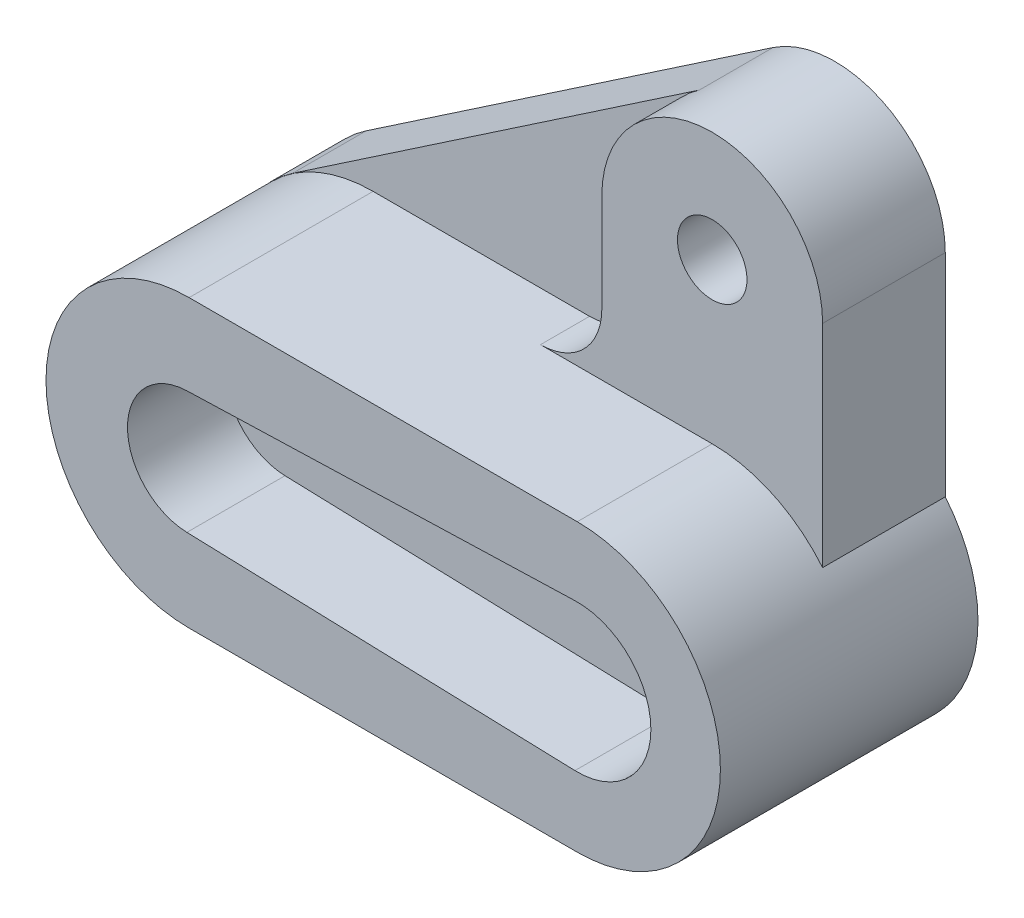
ISO-10303-21;
HEADER;
FILE_DESCRIPTION(('STEP AP214'),'2;1');
FILE_NAME('part.step','',(''),(''),'','','');
FILE_SCHEMA(('AUTOMOTIVE_DESIGN { 1 0 10303 214 1 1 1 1 }'));
ENDSEC;
DATA;
#1=APPLICATION_CONTEXT('core data for automotive mechanical design processes');
#2=APPLICATION_PROTOCOL_DEFINITION('international standard','automotive_design',2000,#1);
#3=PRODUCT_CONTEXT('',#1,'mechanical');
#4=PRODUCT('Part','Part','',(#3));
#5=PRODUCT_RELATED_PRODUCT_CATEGORY('part','',(#4));
#6=PRODUCT_DEFINITION_FORMATION('','',#4);
#7=PRODUCT_DEFINITION_CONTEXT('part definition',#1,'design');
#8=PRODUCT_DEFINITION('design','',#6,#7);
#9=PRODUCT_DEFINITION_SHAPE('','',#8);
#10=(LENGTH_UNIT() NAMED_UNIT(*) SI_UNIT(.MILLI.,.METRE.));
#11=(NAMED_UNIT(*) PLANE_ANGLE_UNIT() SI_UNIT($,.RADIAN.));
#12=(NAMED_UNIT(*) SI_UNIT($,.STERADIAN.) SOLID_ANGLE_UNIT());
#13=UNCERTAINTY_MEASURE_WITH_UNIT(LENGTH_MEASURE(1.E-05),#10,'distance_accuracy_value','');
#14=(GEOMETRIC_REPRESENTATION_CONTEXT(3) GLOBAL_UNCERTAINTY_ASSIGNED_CONTEXT((#13)) GLOBAL_UNIT_ASSIGNED_CONTEXT((#10,
#11,#12)) REPRESENTATION_CONTEXT('',''));
#15=CARTESIAN_POINT('',(0.,0.,0.));
#16=DIRECTION('',(0.,0.,1.));
#17=DIRECTION('',(1.,0.,0.));
#18=AXIS2_PLACEMENT_3D('',#15,#16,#17);
#19=CARTESIAN_POINT('',(-95.,0.,18.));
#20=DIRECTION('',(0.,0.,1.));
#21=DIRECTION('',(1.,0.,0.));
#22=AXIS2_PLACEMENT_3D('',#19,#20,#21);
#23=PLANE('',#22);
#24=DIRECTION('',(1.,0.,0.));
#25=VECTOR('',#24,1.);
#26=CARTESIAN_POINT('',(0.,35.,18.));
#27=LINE('',#26,#25);
#28=CARTESIAN_POINT('',(-94.928572612956,35.,18.));
#29=VERTEX_POINT('',#28);
#30=CARTESIAN_POINT('',(-42.,35.,18.));
#31=VERTEX_POINT('',#30);
#32=EDGE_CURVE('E239',#29,#31,#27,.T.);
#33=ORIENTED_EDGE('',*,*,#32,.T.);
#34=CARTESIAN_POINT('',(-42.,50.,18.));
#35=DIRECTION('',(0.,0.,1.));
#36=DIRECTION('',(1.,0.,0.));
#37=AXIS2_PLACEMENT_3D('',#34,#35,#36);
#38=CIRCLE('',#37,15.);
#39=CARTESIAN_POINT('',(-27.,50.,18.));
#40=VERTEX_POINT('',#39);
#41=EDGE_CURVE('E340',#31,#40,#38,.T.);
#42=ORIENTED_EDGE('',*,*,#41,.T.);
#43=DIRECTION('',(0.,-1.,0.));
#44=VECTOR('',#43,1.);
#45=CARTESIAN_POINT('',(-27.,74.,18.));
#46=LINE('',#45,#44);
#47=CARTESIAN_POINT('',(-27.,74.,18.));
#48=VERTEX_POINT('',#47);
#49=EDGE_CURVE('E225',#48,#40,#46,.T.);
#50=ORIENTED_EDGE('',*,*,#49,.F.);
#51=CARTESIAN_POINT('',(0.,74.,18.));
#52=DIRECTION('',(0.,0.,1.));
#53=DIRECTION('',(1.,0.,0.));
#54=AXIS2_PLACEMENT_3D('',#51,#52,#53);
#55=CIRCLE('',#54,27.);
#56=CARTESIAN_POINT('',(-15.1401853244956,96.3556433219876,18.));
#57=VERTEX_POINT('',#56);
#58=EDGE_CURVE('E220',#57,#48,#55,.T.);
#59=ORIENTED_EDGE('',*,*,#58,.F.);
#60=DIRECTION('',(-0.827986789703244,-0.560747604610948,0.));
#61=VECTOR('',#60,1.);
#62=CARTESIAN_POINT('',(-114.626166161383,28.9795376396135,18.));
#63=LINE('',#62,#61);
#64=CARTESIAN_POINT('',(-114.626166161383,28.9795376396135,18.));
#65=VERTEX_POINT('',#64);
#66=EDGE_CURVE('E306',#57,#65,#63,.T.);
#67=ORIENTED_EDGE('',*,*,#66,.T.);
#68=CARTESIAN_POINT('',(-95.,0.,18.));
#69=DIRECTION('',(0.,0.,1.));
#70=DIRECTION('',(1.,0.,0.));
#71=AXIS2_PLACEMENT_3D('',#68,#69,#70);
#72=CIRCLE('',#71,35.);
#73=CARTESIAN_POINT('',(-95.,-35.,18.));
#74=VERTEX_POINT('',#73);
#75=EDGE_CURVE('E300',#65,#74,#72,.T.);
#76=ORIENTED_EDGE('',*,*,#75,.T.);
#77=DIRECTION('',(1.,0.,0.));
#78=VECTOR('',#77,1.);
#79=CARTESIAN_POINT('',(-95.,-35.,18.));
#80=LINE('',#79,#78);
#81=CARTESIAN_POINT('',(-94.928572612956,-35.,18.));
#82=VERTEX_POINT('',#81);
#83=EDGE_CURVE('E303',#74,#82,#80,.T.);
#84=ORIENTED_EDGE('',*,*,#83,.T.);
#85=CARTESIAN_POINT('',(-94.928572612956,0.,18.));
#86=DIRECTION('',(0.,0.,1.));
#87=DIRECTION('',(1.,0.,0.));
#88=AXIS2_PLACEMENT_3D('',#85,#86,#87);
#89=CIRCLE('',#88,35.);
#90=EDGE_CURVE('E244',#29,#82,#89,.T.);
#91=ORIENTED_EDGE('',*,*,#90,.F.);
#92=EDGE_LOOP('',(#33,#42,#50,#59,#67,#76,#84,#91));
#93=FACE_BOUND('',#92,.T.);
#94=ADVANCED_FACE('F41',(#93),#23,.T.);
#95=CARTESIAN_POINT('',(-95.,0.,0.));
#96=DIRECTION('',(0.,0.,1.));
#97=DIRECTION('',(1.,0.,0.));
#98=AXIS2_PLACEMENT_3D('',#95,#96,#97);
#99=PLANE('',#98);
#100=DIRECTION('',(-0.999501260671092,0.0315789473684354,0.));
#101=VECTOR('',#100,1.);
#102=CARTESIAN_POINT('',(-0.568421052631323,-17.9910226920797,0.));
#103=LINE('',#102,#101);
#104=CARTESIAN_POINT('',(-0.568421052631315,-17.9910226920797,0.));
#105=VERTEX_POINT('',#104);
#106=CARTESIAN_POINT('',(-95.4736842105266,-14.9925189100664,0.));
#107=VERTEX_POINT('',#106);
#108=EDGE_CURVE('E280',#105,#107,#103,.T.);
#109=ORIENTED_EDGE('',*,*,#108,.F.);
#110=CARTESIAN_POINT('',(0.,0.,0.));
#111=DIRECTION('',(0.,0.,-1.));
#112=DIRECTION('',(-1.,0.,0.));
#113=AXIS2_PLACEMENT_3D('',#110,#111,#112);
#114=CIRCLE('',#113,18.);
#115=CARTESIAN_POINT('',(-0.568421052631832,17.9910226920797,0.));
#116=VERTEX_POINT('',#115);
#117=EDGE_CURVE('E264',#116,#105,#114,.T.);
#118=ORIENTED_EDGE('',*,*,#117,.F.);
#119=DIRECTION('',(0.999501260671092,0.0315789473684352,0.));
#120=VECTOR('',#119,1.);
#121=CARTESIAN_POINT('',(-0.568421052631832,17.9910226920797,0.));
#122=LINE('',#121,#120);
#123=CARTESIAN_POINT('',(-95.4736842105266,14.992518910065,0.));
#124=VERTEX_POINT('',#123);
#125=EDGE_CURVE('E269',#124,#116,#122,.T.);
#126=ORIENTED_EDGE('',*,*,#125,.F.);
#127=CARTESIAN_POINT('',(-95.,-1.34422204270401E-12,0.));
#128=DIRECTION('',(0.,0.,-1.));
#129=DIRECTION('',(-1.,0.,0.));
#130=AXIS2_PLACEMENT_3D('',#127,#128,#129);
#131=CIRCLE('',#130,14.9999999999986);
#132=EDGE_CURVE('E283',#107,#124,#131,.T.);
#133=ORIENTED_EDGE('',*,*,#132,.F.);
#134=EDGE_LOOP('',(#109,#118,#126,#133));
#135=FACE_BOUND('',#134,.T.);
#136=CARTESIAN_POINT('',(-95.,0.,0.));
#137=DIRECTION('',(0.,0.,1.));
#138=DIRECTION('',(1.,0.,0.));
#139=AXIS2_PLACEMENT_3D('',#136,#137,#138);
#140=CIRCLE('',#139,35.);
#141=CARTESIAN_POINT('',(-114.626166161383,28.9795376396135,0.));
#142=VERTEX_POINT('',#141);
#143=CARTESIAN_POINT('',(-95.,-35.,0.));
#144=VERTEX_POINT('',#143);
#145=EDGE_CURVE('E299',#142,#144,#140,.T.);
#146=ORIENTED_EDGE('',*,*,#145,.F.);
#147=DIRECTION('',(-0.827986789703244,-0.560747604610948,0.));
#148=VECTOR('',#147,1.);
#149=CARTESIAN_POINT('',(-114.626166161383,28.9795376396135,0.));
#150=LINE('',#149,#148);
#151=CARTESIAN_POINT('',(-15.1401853244956,96.3556433219876,0.));
#152=VERTEX_POINT('',#151);
#153=EDGE_CURVE('E304',#152,#142,#150,.T.);
#154=ORIENTED_EDGE('',*,*,#153,.F.);
#155=CARTESIAN_POINT('',(0.,74.,0.));
#156=DIRECTION('',(0.,0.,1.));
#157=DIRECTION('',(1.,0.,0.));
#158=AXIS2_PLACEMENT_3D('',#155,#156,#157);
#159=CIRCLE('',#158,27.);
#160=CARTESIAN_POINT('',(27.,74.,0.));
#161=VERTEX_POINT('',#160);
#162=EDGE_CURVE('E317',#161,#152,#159,.T.);
#163=ORIENTED_EDGE('',*,*,#162,.F.);
#164=DIRECTION('',(0.,1.,0.));
#165=VECTOR('',#164,1.);
#166=CARTESIAN_POINT('',(27.,74.,0.));
#167=LINE('',#166,#165);
#168=CARTESIAN_POINT('',(27.,22.2710574513201,0.));
#169=VERTEX_POINT('',#168);
#170=EDGE_CURVE('E315',#169,#161,#167,.T.);
#171=ORIENTED_EDGE('',*,*,#170,.F.);
#172=CARTESIAN_POINT('',(0.,0.,0.));
#173=DIRECTION('',(0.,0.,1.));
#174=DIRECTION('',(1.,0.,0.));
#175=AXIS2_PLACEMENT_3D('',#172,#173,#174);
#176=CIRCLE('',#175,35.);
#177=CARTESIAN_POINT('',(0.,-35.,0.));
#178=VERTEX_POINT('',#177);
#179=EDGE_CURVE('E313',#178,#169,#176,.T.);
#180=ORIENTED_EDGE('',*,*,#179,.F.);
#181=DIRECTION('',(1.,0.,0.));
#182=VECTOR('',#181,1.);
#183=CARTESIAN_POINT('',(-95.,-35.,0.));
#184=LINE('',#183,#182);
#185=EDGE_CURVE('E311',#144,#178,#184,.T.);
#186=ORIENTED_EDGE('',*,*,#185,.F.);
#187=EDGE_LOOP('',(#146,#154,#163,#171,#180,#186));
#188=FACE_BOUND('',#187,.T.);
#189=CARTESIAN_POINT('',(0.,74.,0.));
#190=DIRECTION('',(0.,0.,1.));
#191=DIRECTION('',(1.,0.,0.));
#192=AXIS2_PLACEMENT_3D('',#189,#190,#191);
#193=CIRCLE('',#192,8.5);
#194=CARTESIAN_POINT('',(8.5,74.,0.));
#195=VERTEX_POINT('',#194);
#196=EDGE_CURVE('E290',#195,#195,#193,.T.);
#197=ORIENTED_EDGE('',*,*,#196,.T.);
#198=EDGE_LOOP('',(#197));
#199=FACE_BOUND('',#198,.T.);
#200=ADVANCED_FACE('F388',(#135,#188,#199),#99,.F.);
#201=CARTESIAN_POINT('',(-95.,0.,18.));
#202=DIRECTION('',(0.,0.,-1.));
#203=DIRECTION('',(-1.,0.,0.));
#204=AXIS2_PLACEMENT_3D('',#201,#202,#203);
#205=CYLINDRICAL_SURFACE('',#204,35.);
#206=ORIENTED_EDGE('',*,*,#145,.T.);
#207=DIRECTION('',(0.,0.,-1.));
#208=VECTOR('',#207,1.);
#209=CARTESIAN_POINT('',(-95.,-35.,18.));
#210=LINE('',#209,#208);
#211=EDGE_CURVE('E334',#74,#144,#210,.T.);
#212=ORIENTED_EDGE('',*,*,#211,.F.);
#213=ORIENTED_EDGE('',*,*,#75,.F.);
#214=DIRECTION('',(0.,0.,-1.));
#215=VECTOR('',#214,1.);
#216=CARTESIAN_POINT('',(-114.626166161383,28.9795376396135,18.));
#217=LINE('',#216,#215);
#218=EDGE_CURVE('E308',#65,#142,#217,.T.);
#219=ORIENTED_EDGE('',*,*,#218,.T.);
#220=EDGE_LOOP('',(#206,#212,#213,#219));
#221=FACE_BOUND('',#220,.T.);
#222=ADVANCED_FACE('F367',(#221),#205,.T.);
#223=CARTESIAN_POINT('',(-95.,-35.,18.));
#224=DIRECTION('',(0.,1.,0.));
#225=DIRECTION('',(-1.,0.,0.));
#226=AXIS2_PLACEMENT_3D('',#223,#224,#225);
#227=PLANE('',#226);
#228=ORIENTED_EDGE('',*,*,#185,.T.);
#229=DIRECTION('',(0.,0.,-1.));
#230=VECTOR('',#229,1.);
#231=CARTESIAN_POINT('',(0.,-35.,18.));
#232=LINE('',#231,#230);
#233=CARTESIAN_POINT('',(0.,-35.,63.));
#234=VERTEX_POINT('',#233);
#235=EDGE_CURVE('E331',#234,#178,#232,.T.);
#236=ORIENTED_EDGE('',*,*,#235,.F.);
#237=DIRECTION('',(1.,0.,0.));
#238=VECTOR('',#237,1.);
#239=CARTESIAN_POINT('',(0.,-35.,63.));
#240=LINE('',#239,#238);
#241=CARTESIAN_POINT('',(-94.928572612956,-35.,63.));
#242=VERTEX_POINT('',#241);
#243=EDGE_CURVE('E246',#242,#234,#240,.T.);
#244=ORIENTED_EDGE('',*,*,#243,.F.);
#245=DIRECTION('',(0.,0.,-1.));
#246=VECTOR('',#245,1.);
#247=CARTESIAN_POINT('',(-94.928572612956,-35.,63.));
#248=LINE('',#247,#246);
#249=EDGE_CURVE('E258',#242,#82,#248,.T.);
#250=ORIENTED_EDGE('',*,*,#249,.T.);
#251=ORIENTED_EDGE('',*,*,#83,.F.);
#252=ORIENTED_EDGE('',*,*,#211,.T.);
#253=EDGE_LOOP('',(#228,#236,#244,#250,#251,#252));
#254=FACE_BOUND('',#253,.T.);
#255=ADVANCED_FACE('F369',(#254),#227,.F.);
#256=CARTESIAN_POINT('',(0.,0.,18.));
#257=DIRECTION('',(0.,0.,-1.));
#258=DIRECTION('',(-1.,0.,0.));
#259=AXIS2_PLACEMENT_3D('',#256,#257,#258);
#260=CYLINDRICAL_SURFACE('',#259,35.);
#261=DIRECTION('',(0.,0.,-1.));
#262=VECTOR('',#261,1.);
#263=CARTESIAN_POINT('',(27.,22.2710574513201,18.));
#264=LINE('',#263,#262);
#265=CARTESIAN_POINT('',(27.,22.2710574513201,30.));
#266=VERTEX_POINT('',#265);
#267=EDGE_CURVE('E328',#266,#169,#264,.T.);
#268=ORIENTED_EDGE('',*,*,#267,.F.);
#269=CARTESIAN_POINT('',(0.,0.,30.));
#270=DIRECTION('',(0.,0.,-1.));
#271=DIRECTION('',(1.,0.,0.));
#272=AXIS2_PLACEMENT_3D('',#269,#270,#271);
#273=CIRCLE('',#272,35.);
#274=CARTESIAN_POINT('',(0.,35.,30.));
#275=VERTEX_POINT('',#274);
#276=EDGE_CURVE('E221',#275,#266,#273,.T.);
#277=ORIENTED_EDGE('',*,*,#276,.F.);
#278=DIRECTION('',(0.,0.,-1.));
#279=VECTOR('',#278,1.);
#280=CARTESIAN_POINT('',(0.,35.,63.));
#281=LINE('',#280,#279);
#282=CARTESIAN_POINT('',(0.,35.,63.));
#283=VERTEX_POINT('',#282);
#284=EDGE_CURVE('E251',#283,#275,#281,.T.);
#285=ORIENTED_EDGE('',*,*,#284,.F.);
#286=CARTESIAN_POINT('',(0.,0.,63.));
#287=DIRECTION('',(0.,0.,1.));
#288=DIRECTION('',(1.,0.,0.));
#289=AXIS2_PLACEMENT_3D('',#286,#287,#288);
#290=CIRCLE('',#289,35.);
#291=EDGE_CURVE('E249',#234,#283,#290,.T.);
#292=ORIENTED_EDGE('',*,*,#291,.F.);
#293=ORIENTED_EDGE('',*,*,#235,.T.);
#294=ORIENTED_EDGE('',*,*,#179,.T.);
#295=EDGE_LOOP('',(#268,#277,#285,#292,#293,#294));
#296=FACE_BOUND('',#295,.T.);
#297=ADVANCED_FACE('F381',(#296),#260,.T.);
#298=CARTESIAN_POINT('',(27.,74.,18.));
#299=DIRECTION('',(-1.,0.,0.));
#300=DIRECTION('',(0.,0.,1.));
#301=AXIS2_PLACEMENT_3D('',#298,#299,#300);
#302=PLANE('',#301);
#303=ORIENTED_EDGE('',*,*,#170,.T.);
#304=DIRECTION('',(0.,0.,-1.));
#305=VECTOR('',#304,1.);
#306=CARTESIAN_POINT('',(27.,74.,18.));
#307=LINE('',#306,#305);
#308=CARTESIAN_POINT('',(27.,74.,30.));
#309=VERTEX_POINT('',#308);
#310=EDGE_CURVE('E325',#309,#161,#307,.T.);
#311=ORIENTED_EDGE('',*,*,#310,.F.);
#312=DIRECTION('',(0.,1.,0.));
#313=VECTOR('',#312,1.);
#314=CARTESIAN_POINT('',(27.,74.,30.));
#315=LINE('',#314,#313);
#316=EDGE_CURVE('E224',#266,#309,#315,.T.);
#317=ORIENTED_EDGE('',*,*,#316,.F.);
#318=ORIENTED_EDGE('',*,*,#267,.T.);
#319=EDGE_LOOP('',(#303,#311,#317,#318));
#320=FACE_BOUND('',#319,.T.);
#321=ADVANCED_FACE('F385',(#320),#302,.F.);
#322=CARTESIAN_POINT('',(0.,74.,18.));
#323=DIRECTION('',(0.,0.,-1.));
#324=DIRECTION('',(-1.,0.,0.));
#325=AXIS2_PLACEMENT_3D('',#322,#323,#324);
#326=CYLINDRICAL_SURFACE('',#325,27.);
#327=ORIENTED_EDGE('',*,*,#162,.T.);
#328=DIRECTION('',(0.,0.,-1.));
#329=VECTOR('',#328,1.);
#330=CARTESIAN_POINT('',(-15.1401853244956,96.3556433219876,18.));
#331=LINE('',#330,#329);
#332=EDGE_CURVE('E322',#57,#152,#331,.T.);
#333=ORIENTED_EDGE('',*,*,#332,.F.);
#334=ORIENTED_EDGE('',*,*,#58,.T.);
#335=DIRECTION('',(0.,0.,-1.));
#336=VECTOR('',#335,1.);
#337=CARTESIAN_POINT('',(-27.,74.,30.));
#338=LINE('',#337,#336);
#339=CARTESIAN_POINT('',(-27.,74.,30.));
#340=VERTEX_POINT('',#339);
#341=EDGE_CURVE('E234',#340,#48,#338,.T.);
#342=ORIENTED_EDGE('',*,*,#341,.F.);
#343=CARTESIAN_POINT('',(0.,74.,30.));
#344=DIRECTION('',(0.,0.,1.));
#345=DIRECTION('',(1.,0.,0.));
#346=AXIS2_PLACEMENT_3D('',#343,#344,#345);
#347=CIRCLE('',#346,27.);
#348=EDGE_CURVE('E228',#309,#340,#347,.T.);
#349=ORIENTED_EDGE('',*,*,#348,.F.);
#350=ORIENTED_EDGE('',*,*,#310,.T.);
#351=EDGE_LOOP('',(#327,#333,#334,#342,#349,#350));
#352=FACE_BOUND('',#351,.T.);
#353=ADVANCED_FACE('F356',(#352),#326,.T.);
#354=CARTESIAN_POINT('',(-114.626166161383,28.9795376396135,18.));
#355=DIRECTION('',(0.560747604610948,-0.827986789703244,0.));
#356=DIRECTION('',(0.827986789703244,0.560747604610948,0.));
#357=AXIS2_PLACEMENT_3D('',#354,#355,#356);
#358=PLANE('',#357);
#359=ORIENTED_EDGE('',*,*,#153,.T.);
#360=ORIENTED_EDGE('',*,*,#218,.F.);
#361=ORIENTED_EDGE('',*,*,#66,.F.);
#362=ORIENTED_EDGE('',*,*,#332,.T.);
#363=EDGE_LOOP('',(#359,#360,#361,#362));
#364=FACE_BOUND('',#363,.T.);
#365=ADVANCED_FACE('F363',(#364),#358,.F.);
#366=CARTESIAN_POINT('',(0.,74.,18.));
#367=DIRECTION('',(0.,0.,-1.));
#368=DIRECTION('',(-1.,0.,0.));
#369=AXIS2_PLACEMENT_3D('',#366,#367,#368);
#370=CYLINDRICAL_SURFACE('',#369,8.5);
#371=ORIENTED_EDGE('',*,*,#196,.F.);
#372=EDGE_LOOP('',(#371));
#373=FACE_BOUND('',#372,.T.);
#374=CARTESIAN_POINT('',(0.,74.,30.));
#375=DIRECTION('',(0.,0.,1.));
#376=DIRECTION('',(1.,0.,0.));
#377=AXIS2_PLACEMENT_3D('',#374,#375,#376);
#378=CIRCLE('',#377,8.5);
#379=CARTESIAN_POINT('',(8.5,74.,30.));
#380=VERTEX_POINT('',#379);
#381=EDGE_CURVE('E214',#380,#380,#378,.T.);
#382=ORIENTED_EDGE('',*,*,#381,.T.);
#383=EDGE_LOOP('',(#382));
#384=FACE_BOUND('',#383,.T.);
#385=ADVANCED_FACE('F395',(#373,#384),#370,.F.);
#386=CARTESIAN_POINT('',(0.,0.,15.));
#387=DIRECTION('',(0.,0.,-1.));
#388=DIRECTION('',(-1.,0.,0.));
#389=AXIS2_PLACEMENT_3D('',#386,#387,#388);
#390=CYLINDRICAL_SURFACE('',#389,18.);
#391=ORIENTED_EDGE('',*,*,#117,.T.);
#392=DIRECTION('',(0.,0.,-1.));
#393=VECTOR('',#392,1.);
#394=CARTESIAN_POINT('',(-0.568421052631323,-17.9910226920797,15.));
#395=LINE('',#394,#393);
#396=CARTESIAN_POINT('',(-0.568421052631323,-17.9910226920797,15.));
#397=VERTEX_POINT('',#396);
#398=EDGE_CURVE('E278',#397,#105,#395,.T.);
#399=ORIENTED_EDGE('',*,*,#398,.F.);
#400=CARTESIAN_POINT('',(0.,0.,15.));
#401=DIRECTION('',(0.,0.,-1.));
#402=DIRECTION('',(-1.,0.,0.));
#403=AXIS2_PLACEMENT_3D('',#400,#401,#402);
#404=CIRCLE('',#403,18.);
#405=CARTESIAN_POINT('',(-0.568421052631832,17.9910226920797,15.));
#406=VERTEX_POINT('',#405);
#407=EDGE_CURVE('E265',#406,#397,#404,.T.);
#408=ORIENTED_EDGE('',*,*,#407,.F.);
#409=DIRECTION('',(0.,0.,-1.));
#410=VECTOR('',#409,1.);
#411=CARTESIAN_POINT('',(-0.568421052631832,17.9910226920797,15.));
#412=LINE('',#411,#410);
#413=EDGE_CURVE('E288',#406,#116,#412,.T.);
#414=ORIENTED_EDGE('',*,*,#413,.T.);
#415=EDGE_LOOP('',(#391,#399,#408,#414));
#416=FACE_BOUND('',#415,.T.);
#417=ADVANCED_FACE('F398',(#416),#390,.F.);
#418=CARTESIAN_POINT('',(-0.568421052631832,17.9910226920797,15.));
#419=DIRECTION('',(-0.0315789473684352,0.999501260671092,0.));
#420=DIRECTION('',(-0.999501260671092,-0.0315789473684352,0.));
#421=AXIS2_PLACEMENT_3D('',#418,#419,#420);
#422=PLANE('',#421);
#423=ORIENTED_EDGE('',*,*,#125,.T.);
#424=ORIENTED_EDGE('',*,*,#413,.F.);
#425=DIRECTION('',(0.999501260671092,0.0315789473684352,0.));
#426=VECTOR('',#425,1.);
#427=CARTESIAN_POINT('',(-0.568421052631832,17.9910226920797,15.));
#428=LINE('',#427,#426);
#429=CARTESIAN_POINT('',(-95.4736842105266,14.992518910065,15.));
#430=VERTEX_POINT('',#429);
#431=EDGE_CURVE('E275',#430,#406,#428,.T.);
#432=ORIENTED_EDGE('',*,*,#431,.F.);
#433=DIRECTION('',(0.,0.,-1.));
#434=VECTOR('',#433,1.);
#435=CARTESIAN_POINT('',(-95.4736842105266,14.992518910065,15.));
#436=LINE('',#435,#434);
#437=EDGE_CURVE('E291',#430,#124,#436,.T.);
#438=ORIENTED_EDGE('',*,*,#437,.T.);
#439=EDGE_LOOP('',(#423,#424,#432,#438));
#440=FACE_BOUND('',#439,.T.);
#441=ADVANCED_FACE('F444',(#440),#422,.F.);
#442=CARTESIAN_POINT('',(-95.,-1.34422204270401E-12,15.));
#443=DIRECTION('',(0.,0.,-1.));
#444=DIRECTION('',(-1.,0.,0.));
#445=AXIS2_PLACEMENT_3D('',#442,#443,#444);
#446=CYLINDRICAL_SURFACE('',#445,14.9999999999986);
#447=ORIENTED_EDGE('',*,*,#132,.T.);
#448=ORIENTED_EDGE('',*,*,#437,.F.);
#449=CARTESIAN_POINT('',(-95.,-1.34422204270401E-12,15.));
#450=DIRECTION('',(0.,0.,-1.));
#451=DIRECTION('',(-1.,0.,0.));
#452=AXIS2_PLACEMENT_3D('',#449,#450,#451);
#453=CIRCLE('',#452,14.9999999999986);
#454=CARTESIAN_POINT('',(-95.4736842105266,-14.9925189100664,15.));
#455=VERTEX_POINT('',#454);
#456=EDGE_CURVE('E272',#455,#430,#453,.T.);
#457=ORIENTED_EDGE('',*,*,#456,.F.);
#458=DIRECTION('',(0.,0.,-1.));
#459=VECTOR('',#458,1.);
#460=CARTESIAN_POINT('',(-95.4736842105266,-14.9925189100664,15.));
#461=LINE('',#460,#459);
#462=EDGE_CURVE('E293',#455,#107,#461,.T.);
#463=ORIENTED_EDGE('',*,*,#462,.T.);
#464=EDGE_LOOP('',(#447,#448,#457,#463));
#465=FACE_BOUND('',#464,.T.);
#466=ADVANCED_FACE('F453',(#465),#446,.F.);
#467=CARTESIAN_POINT('',(-0.568421052631323,-17.9910226920797,15.));
#468=DIRECTION('',(-0.0315789473684354,-0.999501260671092,0.));
#469=DIRECTION('',(0.999501260671092,-0.0315789473684354,0.));
#470=AXIS2_PLACEMENT_3D('',#467,#468,#469);
#471=PLANE('',#470);
#472=ORIENTED_EDGE('',*,*,#108,.T.);
#473=ORIENTED_EDGE('',*,*,#462,.F.);
#474=DIRECTION('',(-0.999501260671092,0.0315789473684354,0.));
#475=VECTOR('',#474,1.);
#476=CARTESIAN_POINT('',(-0.568421052631323,-17.9910226920797,15.));
#477=LINE('',#476,#475);
#478=EDGE_CURVE('E268',#397,#455,#477,.T.);
#479=ORIENTED_EDGE('',*,*,#478,.F.);
#480=ORIENTED_EDGE('',*,*,#398,.T.);
#481=EDGE_LOOP('',(#472,#473,#479,#480));
#482=FACE_BOUND('',#481,.T.);
#483=ADVANCED_FACE('F462',(#482),#471,.F.);
#484=CARTESIAN_POINT('',(0.,0.,15.));
#485=DIRECTION('',(0.,0.,-1.));
#486=DIRECTION('',(-1.,0.,0.));
#487=AXIS2_PLACEMENT_3D('',#484,#485,#486);
#488=PLANE('',#487);
#489=ORIENTED_EDGE('',*,*,#407,.T.);
#490=ORIENTED_EDGE('',*,*,#478,.T.);
#491=ORIENTED_EDGE('',*,*,#456,.T.);
#492=ORIENTED_EDGE('',*,*,#431,.T.);
#493=EDGE_LOOP('',(#489,#490,#491,#492));
#494=FACE_BOUND('',#493,.T.);
#495=ADVANCED_FACE('F471',(#494),#488,.T.);
#496=CARTESIAN_POINT('',(0.,35.,63.));
#497=DIRECTION('',(0.,1.,0.));
#498=DIRECTION('',(0.,0.,1.));
#499=AXIS2_PLACEMENT_3D('',#496,#497,#498);
#500=PLANE('',#499);
#501=DIRECTION('',(1.,0.,0.));
#502=VECTOR('',#501,1.);
#503=CARTESIAN_POINT('',(-27.,35.,30.));
#504=LINE('',#503,#502);
#505=CARTESIAN_POINT('',(-42.,35.,30.));
#506=VERTEX_POINT('',#505);
#507=EDGE_CURVE('E232',#506,#275,#504,.T.);
#508=ORIENTED_EDGE('',*,*,#507,.F.);
#509=DIRECTION('',(0.,0.,-1.));
#510=VECTOR('',#509,1.);
#511=CARTESIAN_POINT('',(-42.,35.,63.));
#512=LINE('',#511,#510);
#513=EDGE_CURVE('E337',#506,#31,#512,.T.);
#514=ORIENTED_EDGE('',*,*,#513,.T.);
#515=ORIENTED_EDGE('',*,*,#32,.F.);
#516=DIRECTION('',(0.,0.,-1.));
#517=VECTOR('',#516,1.);
#518=CARTESIAN_POINT('',(-94.928572612956,35.,63.));
#519=LINE('',#518,#517);
#520=CARTESIAN_POINT('',(-94.928572612956,35.,63.));
#521=VERTEX_POINT('',#520);
#522=EDGE_CURVE('E261',#521,#29,#519,.T.);
#523=ORIENTED_EDGE('',*,*,#522,.F.);
#524=DIRECTION('',(1.,0.,0.));
#525=VECTOR('',#524,1.);
#526=CARTESIAN_POINT('',(0.,35.,63.));
#527=LINE('',#526,#525);
#528=EDGE_CURVE('E240',#521,#283,#527,.T.);
#529=ORIENTED_EDGE('',*,*,#528,.T.);
#530=ORIENTED_EDGE('',*,*,#284,.T.);
#531=EDGE_LOOP('',(#508,#514,#515,#523,#529,#530));
#532=FACE_BOUND('',#531,.T.);
#533=ADVANCED_FACE('F377',(#532),#500,.T.);
#534=CARTESIAN_POINT('',(-94.928572612956,0.,63.));
#535=DIRECTION('',(0.,0.,-1.));
#536=DIRECTION('',(-1.,0.,0.));
#537=AXIS2_PLACEMENT_3D('',#534,#535,#536);
#538=CYLINDRICAL_SURFACE('',#537,35.);
#539=ORIENTED_EDGE('',*,*,#90,.T.);
#540=ORIENTED_EDGE('',*,*,#249,.F.);
#541=CARTESIAN_POINT('',(-94.928572612956,0.,63.));
#542=DIRECTION('',(0.,0.,1.));
#543=DIRECTION('',(1.,0.,0.));
#544=AXIS2_PLACEMENT_3D('',#541,#542,#543);
#545=CIRCLE('',#544,35.);
#546=EDGE_CURVE('E243',#521,#242,#545,.T.);
#547=ORIENTED_EDGE('',*,*,#546,.F.);
#548=ORIENTED_EDGE('',*,*,#522,.T.);
#549=EDGE_LOOP('',(#539,#540,#547,#548));
#550=FACE_BOUND('',#549,.T.);
#551=ADVANCED_FACE('F373',(#550),#538,.T.);
#552=CARTESIAN_POINT('',(0.,0.,63.));
#553=DIRECTION('',(0.,0.,1.));
#554=DIRECTION('',(1.,0.,0.));
#555=AXIS2_PLACEMENT_3D('',#552,#553,#554);
#556=PLANE('',#555);
#557=CARTESIAN_POINT('',(-95.,0.,63.));
#558=DIRECTION('',(0.,0.,1.));
#559=DIRECTION('',(1.,0.,0.));
#560=AXIS2_PLACEMENT_3D('',#557,#558,#559);
#561=CIRCLE('',#560,15.);
#562=CARTESIAN_POINT('',(-95.4736842105263,14.9925189100664,63.));
#563=VERTEX_POINT('',#562);
#564=CARTESIAN_POINT('',(-95.4736842105263,-14.9925189100664,63.));
#565=VERTEX_POINT('',#564);
#566=EDGE_CURVE('E56',#563,#565,#561,.T.);
#567=ORIENTED_EDGE('',*,*,#566,.F.);
#568=DIRECTION('',(-0.999501260671092,-0.0315789473684212,0.));
#569=VECTOR('',#568,1.);
#570=CARTESIAN_POINT('',(-95.4736842105263,14.9925189100664,63.));
#571=LINE('',#570,#569);
#572=CARTESIAN_POINT('',(-0.568421052631581,17.9910226920797,63.));
#573=VERTEX_POINT('',#572);
#574=EDGE_CURVE('E199',#573,#563,#571,.T.);
#575=ORIENTED_EDGE('',*,*,#574,.F.);
#576=CARTESIAN_POINT('',(0.,0.,63.));
#577=DIRECTION('',(0.,0.,1.));
#578=DIRECTION('',(1.,0.,0.));
#579=AXIS2_PLACEMENT_3D('',#576,#577,#578);
#580=CIRCLE('',#579,18.);
#581=CARTESIAN_POINT('',(-0.568421052631581,-17.9910226920797,63.));
#582=VERTEX_POINT('',#581);
#583=EDGE_CURVE('E202',#582,#573,#580,.T.);
#584=ORIENTED_EDGE('',*,*,#583,.F.);
#585=DIRECTION('',(0.999501260671092,-0.0315789473684209,0.));
#586=VECTOR('',#585,1.);
#587=CARTESIAN_POINT('',(-95.4736842105263,-14.9925189100664,63.));
#588=LINE('',#587,#586);
#589=EDGE_CURVE('E208',#565,#582,#588,.T.);
#590=ORIENTED_EDGE('',*,*,#589,.F.);
#591=EDGE_LOOP('',(#567,#575,#584,#590));
#592=FACE_BOUND('',#591,.T.);
#593=ORIENTED_EDGE('',*,*,#528,.F.);
#594=ORIENTED_EDGE('',*,*,#546,.T.);
#595=ORIENTED_EDGE('',*,*,#243,.T.);
#596=ORIENTED_EDGE('',*,*,#291,.T.);
#597=EDGE_LOOP('',(#593,#594,#595,#596));
#598=FACE_BOUND('',#597,.T.);
#599=ADVANCED_FACE('F402',(#592,#598),#556,.T.);
#600=CARTESIAN_POINT('',(0.,0.,30.));
#601=DIRECTION('',(0.,0.,1.));
#602=DIRECTION('',(1.,0.,0.));
#603=AXIS2_PLACEMENT_3D('',#600,#601,#602);
#604=PLANE('',#603);
#605=ORIENTED_EDGE('',*,*,#276,.T.);
#606=ORIENTED_EDGE('',*,*,#316,.T.);
#607=ORIENTED_EDGE('',*,*,#348,.T.);
#608=DIRECTION('',(0.,-1.,0.));
#609=VECTOR('',#608,1.);
#610=CARTESIAN_POINT('',(-27.,74.,30.));
#611=LINE('',#610,#609);
#612=CARTESIAN_POINT('',(-27.,50.,30.));
#613=VERTEX_POINT('',#612);
#614=EDGE_CURVE('E230',#340,#613,#611,.T.);
#615=ORIENTED_EDGE('',*,*,#614,.T.);
#616=CARTESIAN_POINT('',(-42.,50.,30.));
#617=DIRECTION('',(0.,0.,1.));
#618=DIRECTION('',(1.,0.,0.));
#619=AXIS2_PLACEMENT_3D('',#616,#617,#618);
#620=CIRCLE('',#619,15.);
#621=EDGE_CURVE('E11',#613,#506,#620,.F.);
#622=ORIENTED_EDGE('',*,*,#621,.T.);
#623=ORIENTED_EDGE('',*,*,#507,.T.);
#624=EDGE_LOOP('',(#605,#606,#607,#615,#622,#623));
#625=FACE_BOUND('',#624,.T.);
#626=ORIENTED_EDGE('',*,*,#381,.F.);
#627=EDGE_LOOP('',(#626));
#628=FACE_BOUND('',#627,.T.);
#629=ADVANCED_FACE('F350',(#625,#628),#604,.T.);
#630=CARTESIAN_POINT('',(-27.,74.,30.));
#631=DIRECTION('',(1.,0.,0.));
#632=DIRECTION('',(0.,1.,0.));
#633=AXIS2_PLACEMENT_3D('',#630,#631,#632);
#634=PLANE('',#633);
#635=ORIENTED_EDGE('',*,*,#49,.T.);
#636=DIRECTION('',(0.,0.,-1.));
#637=VECTOR('',#636,1.);
#638=CARTESIAN_POINT('',(-27.,50.,30.));
#639=LINE('',#638,#637);
#640=EDGE_CURVE('E49',#40,#613,#639,.F.);
#641=ORIENTED_EDGE('',*,*,#640,.T.);
#642=ORIENTED_EDGE('',*,*,#614,.F.);
#643=ORIENTED_EDGE('',*,*,#341,.T.);
#644=EDGE_LOOP('',(#635,#641,#642,#643));
#645=FACE_BOUND('',#644,.T.);
#646=ADVANCED_FACE('F346',(#645),#634,.F.);
#647=CARTESIAN_POINT('',(-42.,50.,63.));
#648=DIRECTION('',(0.,0.,-1.));
#649=DIRECTION('',(-1.,0.,0.));
#650=AXIS2_PLACEMENT_3D('',#647,#648,#649);
#651=CYLINDRICAL_SURFACE('',#650,15.);
#652=ORIENTED_EDGE('',*,*,#621,.F.);
#653=ORIENTED_EDGE('',*,*,#640,.F.);
#654=ORIENTED_EDGE('',*,*,#41,.F.);
#655=ORIENTED_EDGE('',*,*,#513,.F.);
#656=EDGE_LOOP('',(#652,#653,#654,#655));
#657=FACE_BOUND('',#656,.T.);
#658=ADVANCED_FACE('F43',(#657),#651,.F.);
#659=CARTESIAN_POINT('',(-95.,0.,39.));
#660=DIRECTION('',(0.,0.,1.));
#661=DIRECTION('',(1.,0.,0.));
#662=AXIS2_PLACEMENT_3D('',#659,#660,#661);
#663=CYLINDRICAL_SURFACE('',#662,15.);
#664=ORIENTED_EDGE('',*,*,#566,.T.);
#665=DIRECTION('',(0.,0.,1.));
#666=VECTOR('',#665,1.);
#667=CARTESIAN_POINT('',(-95.4736842105263,-14.9925189100664,39.));
#668=LINE('',#667,#666);
#669=CARTESIAN_POINT('',(-95.4736842105263,-14.9925189100664,39.));
#670=VERTEX_POINT('',#669);
#671=EDGE_CURVE('E177',#670,#565,#668,.T.);
#672=ORIENTED_EDGE('',*,*,#671,.F.);
#673=CARTESIAN_POINT('',(-95.,0.,39.));
#674=DIRECTION('',(0.,0.,1.));
#675=DIRECTION('',(1.,0.,0.));
#676=AXIS2_PLACEMENT_3D('',#673,#674,#675);
#677=CIRCLE('',#676,15.);
#678=CARTESIAN_POINT('',(-95.4736842105263,14.9925189100664,39.));
#679=VERTEX_POINT('',#678);
#680=EDGE_CURVE('E181',#679,#670,#677,.T.);
#681=ORIENTED_EDGE('',*,*,#680,.F.);
#682=DIRECTION('',(0.,0.,1.));
#683=VECTOR('',#682,1.);
#684=CARTESIAN_POINT('',(-95.4736842105263,14.9925189100664,39.));
#685=LINE('',#684,#683);
#686=EDGE_CURVE('E212',#679,#563,#685,.T.);
#687=ORIENTED_EDGE('',*,*,#686,.T.);
#688=EDGE_LOOP('',(#664,#672,#681,#687));
#689=FACE_BOUND('',#688,.T.);
#690=ADVANCED_FACE('F179',(#689),#663,.F.);
#691=CARTESIAN_POINT('',(-95.4736842105263,14.9925189100664,39.));
#692=DIRECTION('',(-0.0315789473684212,0.999501260671092,0.));
#693=DIRECTION('',(-0.999501260671092,-0.0315789473684212,0.));
#694=AXIS2_PLACEMENT_3D('',#691,#692,#693);
#695=PLANE('',#694);
#696=ORIENTED_EDGE('',*,*,#574,.T.);
#697=ORIENTED_EDGE('',*,*,#686,.F.);
#698=DIRECTION('',(-0.999501260671092,-0.0315789473684212,0.));
#699=VECTOR('',#698,1.);
#700=CARTESIAN_POINT('',(-95.4736842105263,14.9925189100664,39.));
#701=LINE('',#700,#699);
#702=CARTESIAN_POINT('',(-0.568421052631581,17.9910226920797,39.));
#703=VERTEX_POINT('',#702);
#704=EDGE_CURVE('E187',#703,#679,#701,.T.);
#705=ORIENTED_EDGE('',*,*,#704,.F.);
#706=DIRECTION('',(0.,0.,1.));
#707=VECTOR('',#706,1.);
#708=CARTESIAN_POINT('',(-0.568421052631581,17.9910226920797,39.));
#709=LINE('',#708,#707);
#710=EDGE_CURVE('E215',#703,#573,#709,.T.);
#711=ORIENTED_EDGE('',*,*,#710,.T.);
#712=EDGE_LOOP('',(#696,#697,#705,#711));
#713=FACE_BOUND('',#712,.T.);
#714=ADVANCED_FACE('F549',(#713),#695,.F.);
#715=CARTESIAN_POINT('',(0.,0.,39.));
#716=DIRECTION('',(0.,0.,1.));
#717=DIRECTION('',(1.,0.,0.));
#718=AXIS2_PLACEMENT_3D('',#715,#716,#717);
#719=CYLINDRICAL_SURFACE('',#718,18.);
#720=ORIENTED_EDGE('',*,*,#583,.T.);
#721=ORIENTED_EDGE('',*,*,#710,.F.);
#722=CARTESIAN_POINT('',(0.,0.,39.));
#723=DIRECTION('',(0.,0.,1.));
#724=DIRECTION('',(1.,0.,0.));
#725=AXIS2_PLACEMENT_3D('',#722,#723,#724);
#726=CIRCLE('',#725,18.);
#727=CARTESIAN_POINT('',(-0.568421052631581,-17.9910226920797,39.));
#728=VERTEX_POINT('',#727);
#729=EDGE_CURVE('E195',#728,#703,#726,.T.);
#730=ORIENTED_EDGE('',*,*,#729,.F.);
#731=DIRECTION('',(0.,0.,1.));
#732=VECTOR('',#731,1.);
#733=CARTESIAN_POINT('',(-0.568421052631581,-17.9910226920797,39.));
#734=LINE('',#733,#732);
#735=EDGE_CURVE('E186',#728,#582,#734,.T.);
#736=ORIENTED_EDGE('',*,*,#735,.T.);
#737=EDGE_LOOP('',(#720,#721,#730,#736));
#738=FACE_BOUND('',#737,.T.);
#739=ADVANCED_FACE('F557',(#738),#719,.F.);
#740=CARTESIAN_POINT('',(-95.4736842105263,-14.9925189100664,39.));
#741=DIRECTION('',(-0.0315789473684209,-0.999501260671092,0.));
#742=DIRECTION('',(0.999501260671092,-0.0315789473684209,0.));
#743=AXIS2_PLACEMENT_3D('',#740,#741,#742);
#744=PLANE('',#743);
#745=ORIENTED_EDGE('',*,*,#589,.T.);
#746=ORIENTED_EDGE('',*,*,#735,.F.);
#747=DIRECTION('',(0.999501260671092,-0.0315789473684209,0.));
#748=VECTOR('',#747,1.);
#749=CARTESIAN_POINT('',(-95.4736842105263,-14.9925189100664,39.));
#750=LINE('',#749,#748);
#751=EDGE_CURVE('E190',#670,#728,#750,.T.);
#752=ORIENTED_EDGE('',*,*,#751,.F.);
#753=ORIENTED_EDGE('',*,*,#671,.T.);
#754=EDGE_LOOP('',(#745,#746,#752,#753));
#755=FACE_BOUND('',#754,.T.);
#756=ADVANCED_FACE('F191',(#755),#744,.F.);
#757=CARTESIAN_POINT('',(-95.,0.,39.));
#758=DIRECTION('',(0.,0.,1.));
#759=DIRECTION('',(1.,0.,0.));
#760=AXIS2_PLACEMENT_3D('',#757,#758,#759);
#761=PLANE('',#760);
#762=ORIENTED_EDGE('',*,*,#680,.T.);
#763=ORIENTED_EDGE('',*,*,#751,.T.);
#764=ORIENTED_EDGE('',*,*,#729,.T.);
#765=ORIENTED_EDGE('',*,*,#704,.T.);
#766=EDGE_LOOP('',(#762,#763,#764,#765));
#767=FACE_BOUND('',#766,.T.);
#768=ADVANCED_FACE('F197',(#767),#761,.T.);
#769=CLOSED_SHELL('',(#94,#200,#222,#255,#297,#321,#353,#365,#385,#417,#441,#466,#483,#495,#533,
#551,#599,#629,#646,#658,#690,#714,#739,#756,#768));
#770=MANIFOLD_SOLID_BREP('B2',#769);
#771=ADVANCED_BREP_SHAPE_REPRESENTATION('',(#18,#770),#14);
#772=SHAPE_DEFINITION_REPRESENTATION(#9,#771);
ENDSEC;
END-ISO-10303-21;
